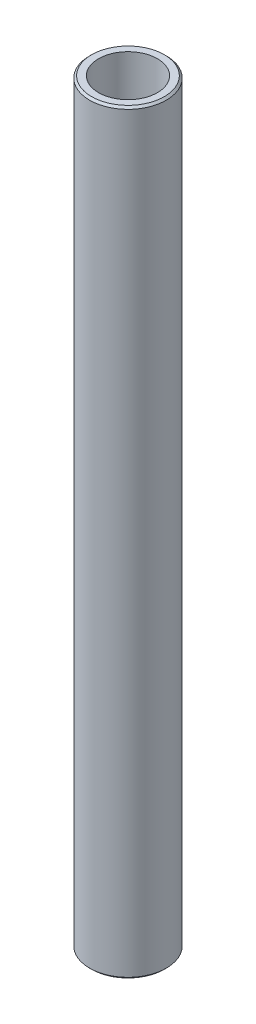
ISO-10303-21;
HEADER;
FILE_DESCRIPTION(('STEP AP214'),'2;1');
FILE_NAME('part.step','',(''),(''),'','','');
FILE_SCHEMA(('AUTOMOTIVE_DESIGN { 1 0 10303 214 1 1 1 1 }'));
ENDSEC;
DATA;
#1=APPLICATION_CONTEXT('core data for automotive mechanical design processes');
#2=APPLICATION_PROTOCOL_DEFINITION('international standard','automotive_design',2000,#1);
#3=PRODUCT_CONTEXT('',#1,'mechanical');
#4=PRODUCT('Part','Part','',(#3));
#5=PRODUCT_RELATED_PRODUCT_CATEGORY('part','',(#4));
#6=PRODUCT_DEFINITION_FORMATION('','',#4);
#7=PRODUCT_DEFINITION_CONTEXT('part definition',#1,'design');
#8=PRODUCT_DEFINITION('design','',#6,#7);
#9=PRODUCT_DEFINITION_SHAPE('','',#8);
#10=(LENGTH_UNIT() NAMED_UNIT(*) SI_UNIT(.MILLI.,.METRE.));
#11=(NAMED_UNIT(*) PLANE_ANGLE_UNIT() SI_UNIT($,.RADIAN.));
#12=(NAMED_UNIT(*) SI_UNIT($,.STERADIAN.) SOLID_ANGLE_UNIT());
#13=UNCERTAINTY_MEASURE_WITH_UNIT(LENGTH_MEASURE(1.E-05),#10,'distance_accuracy_value','');
#14=(GEOMETRIC_REPRESENTATION_CONTEXT(3) GLOBAL_UNCERTAINTY_ASSIGNED_CONTEXT((#13)) GLOBAL_UNIT_ASSIGNED_CONTEXT((#10,
#11,#12)) REPRESENTATION_CONTEXT('',''));
#15=CARTESIAN_POINT('',(0.,0.,0.));
#16=DIRECTION('',(0.,0.,1.));
#17=DIRECTION('',(1.,0.,0.));
#18=AXIS2_PLACEMENT_3D('',#15,#16,#17);
#19=CARTESIAN_POINT('',(0.,590.771823039645,0.));
#20=DIRECTION('',(0.,-1.,0.));
#21=DIRECTION('',(0.,0.,-1.));
#22=AXIS2_PLACEMENT_3D('',#19,#20,#21);
#23=CYLINDRICAL_SURFACE('',#22,30.);
#24=CARTESIAN_POINT('',(0.,589.186750883481,0.));
#25=DIRECTION('',(0.,1.,0.));
#26=DIRECTION('',(0.,0.,1.));
#27=AXIS2_PLACEMENT_3D('',#24,#25,#26);
#28=CIRCLE('',#27,30.);
#29=CARTESIAN_POINT('',(0.,589.186750883481,30.));
#30=VERTEX_POINT('',#29);
#31=EDGE_CURVE('E50',#30,#30,#28,.F.);
#32=ORIENTED_EDGE('',*,*,#31,.T.);
#33=EDGE_LOOP('',(#32));
#34=FACE_BOUND('',#33,.T.);
#35=CARTESIAN_POINT('',(0.,1.5850721561641,0.));
#36=DIRECTION('',(0.,1.,0.));
#37=DIRECTION('',(0.,0.,1.));
#38=AXIS2_PLACEMENT_3D('',#35,#36,#37);
#39=CIRCLE('',#38,30.);
#40=CARTESIAN_POINT('',(0.,1.5850721561641,30.));
#41=VERTEX_POINT('',#40);
#42=EDGE_CURVE('E51',#41,#41,#39,.T.);
#43=ORIENTED_EDGE('',*,*,#42,.T.);
#44=EDGE_LOOP('',(#43));
#45=FACE_BOUND('',#44,.T.);
#46=ADVANCED_FACE('F39',(#34,#45),#23,.T.);
#47=CARTESIAN_POINT('',(0.,590.771823039645,0.));
#48=DIRECTION('',(0.,1.,0.));
#49=DIRECTION('',(0.,0.,1.));
#50=AXIS2_PLACEMENT_3D('',#47,#48,#49);
#51=PLANE('',#50);
#52=CARTESIAN_POINT('',(0.,590.771823039645,0.));
#53=DIRECTION('',(0.,1.,0.));
#54=DIRECTION('',(0.,0.,1.));
#55=AXIS2_PLACEMENT_3D('',#52,#53,#54);
#56=CIRCLE('',#55,28.4149278438359);
#57=CARTESIAN_POINT('',(0.,590.771823039645,28.4149278438359));
#58=VERTEX_POINT('',#57);
#59=EDGE_CURVE('E54',#58,#58,#56,.T.);
#60=ORIENTED_EDGE('',*,*,#59,.T.);
#61=EDGE_LOOP('',(#60));
#62=FACE_BOUND('',#61,.T.);
#63=CARTESIAN_POINT('',(0.,590.771823039645,0.));
#64=DIRECTION('',(0.,1.,0.));
#65=DIRECTION('',(0.,0.,1.));
#66=AXIS2_PLACEMENT_3D('',#63,#64,#65);
#67=CIRCLE('',#66,23.0093082783323);
#68=CARTESIAN_POINT('',(0.,590.771823039645,23.0093082783323));
#69=VERTEX_POINT('',#68);
#70=EDGE_CURVE('E58',#69,#69,#67,.T.);
#71=ORIENTED_EDGE('',*,*,#70,.F.);
#72=EDGE_LOOP('',(#71));
#73=FACE_BOUND('',#72,.T.);
#74=ADVANCED_FACE('F69',(#62,#73),#51,.T.);
#75=CARTESIAN_POINT('',(0.,0.,0.));
#76=DIRECTION('',(0.,1.,0.));
#77=DIRECTION('',(0.,0.,1.));
#78=AXIS2_PLACEMENT_3D('',#75,#76,#77);
#79=PLANE('',#78);
#80=CARTESIAN_POINT('',(0.,0.,0.));
#81=DIRECTION('',(0.,1.,0.));
#82=DIRECTION('',(0.,0.,1.));
#83=AXIS2_PLACEMENT_3D('',#80,#81,#82);
#84=CIRCLE('',#83,28.4149278438359);
#85=CARTESIAN_POINT('',(0.,0.,28.4149278438359));
#86=VERTEX_POINT('',#85);
#87=EDGE_CURVE('E10',#86,#86,#84,.F.);
#88=ORIENTED_EDGE('',*,*,#87,.T.);
#89=EDGE_LOOP('',(#88));
#90=FACE_BOUND('',#89,.T.);
#91=CARTESIAN_POINT('',(0.,0.,0.));
#92=DIRECTION('',(0.,1.,0.));
#93=DIRECTION('',(0.,0.,1.));
#94=AXIS2_PLACEMENT_3D('',#91,#92,#93);
#95=CIRCLE('',#94,23.0093082783323);
#96=CARTESIAN_POINT('',(0.,0.,23.0093082783323));
#97=VERTEX_POINT('',#96);
#98=EDGE_CURVE('E63',#97,#97,#95,.T.);
#99=ORIENTED_EDGE('',*,*,#98,.T.);
#100=EDGE_LOOP('',(#99));
#101=FACE_BOUND('',#100,.T.);
#102=ADVANCED_FACE('F75',(#90,#101),#79,.F.);
#103=CARTESIAN_POINT('',(0.,590.771823039645,0.));
#104=DIRECTION('',(0.,-1.,0.));
#105=DIRECTION('',(0.,0.,-1.));
#106=AXIS2_PLACEMENT_3D('',#103,#104,#105);
#107=CYLINDRICAL_SURFACE('',#106,23.0093082783323);
#108=ORIENTED_EDGE('',*,*,#70,.T.);
#109=EDGE_LOOP('',(#108));
#110=FACE_BOUND('',#109,.T.);
#111=ORIENTED_EDGE('',*,*,#98,.F.);
#112=EDGE_LOOP('',(#111));
#113=FACE_BOUND('',#112,.T.);
#114=ADVANCED_FACE('F70',(#110,#113),#107,.F.);
#115=CARTESIAN_POINT('',(0.,590.771823039645,0.));
#116=DIRECTION('',(0.,-1.,0.));
#117=DIRECTION('',(0.,0.,-1.));
#118=AXIS2_PLACEMENT_3D('',#115,#116,#117);
#119=CONICAL_SURFACE('',#118,28.4149278438359,0.785398163397457);
#120=ORIENTED_EDGE('',*,*,#31,.F.);
#121=EDGE_LOOP('',(#120));
#122=FACE_BOUND('',#121,.T.);
#123=ORIENTED_EDGE('',*,*,#59,.F.);
#124=EDGE_LOOP('',(#123));
#125=FACE_BOUND('',#124,.T.);
#126=ADVANCED_FACE('F81',(#122,#125),#119,.T.);
#127=CARTESIAN_POINT('',(0.,1.5850721561641,0.));
#128=DIRECTION('',(0.,1.,0.));
#129=DIRECTION('',(0.,0.,1.));
#130=AXIS2_PLACEMENT_3D('',#127,#128,#129);
#131=CONICAL_SURFACE('',#130,30.,0.785398163397457);
#132=ORIENTED_EDGE('',*,*,#87,.F.);
#133=EDGE_LOOP('',(#132));
#134=FACE_BOUND('',#133,.T.);
#135=ORIENTED_EDGE('',*,*,#42,.F.);
#136=EDGE_LOOP('',(#135));
#137=FACE_BOUND('',#136,.T.);
#138=ADVANCED_FACE('F45',(#134,#137),#131,.T.);
#139=CLOSED_SHELL('',(#46,#74,#102,#114,#126,#138));
#140=MANIFOLD_SOLID_BREP('B2',#139);
#141=ADVANCED_BREP_SHAPE_REPRESENTATION('',(#18,#140),#14);
#142=SHAPE_DEFINITION_REPRESENTATION(#9,#141);
ENDSEC;
END-ISO-10303-21;
